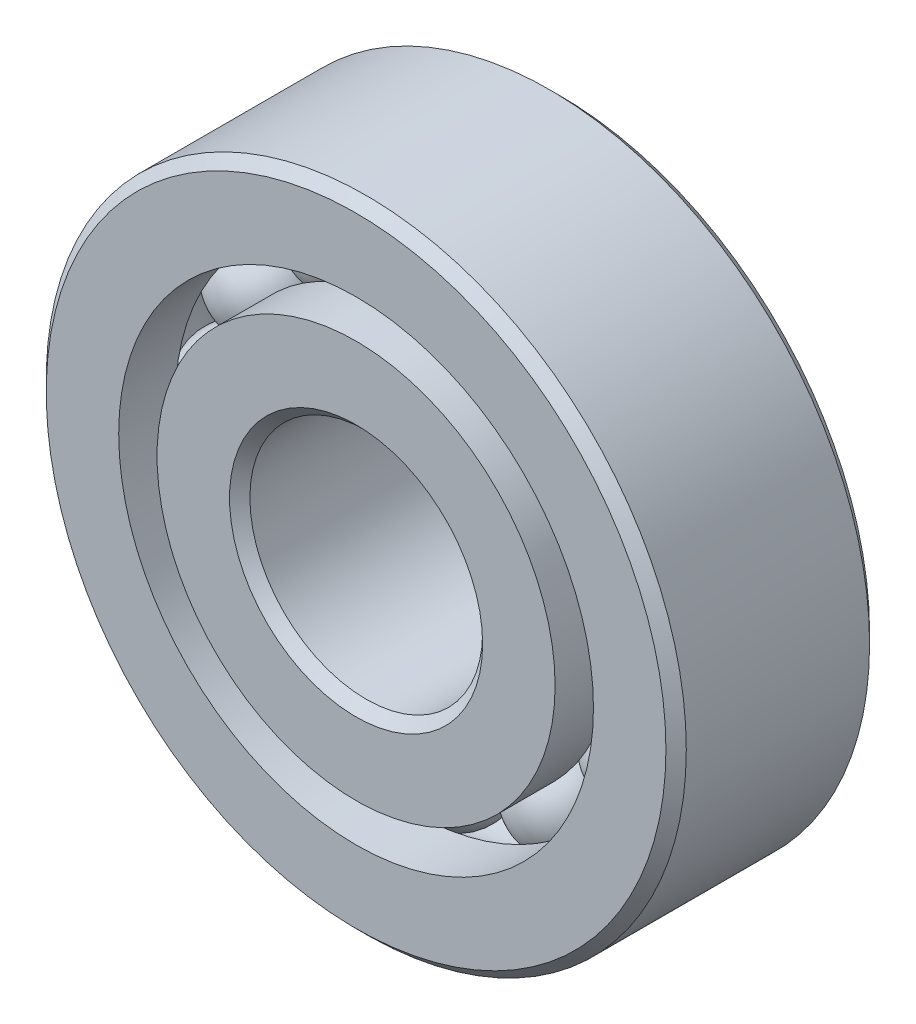
ISO-10303-21;
HEADER;
FILE_DESCRIPTION(('STEP AP214'),'2;1');
FILE_NAME('part.step','',(''),(''),'','','');
FILE_SCHEMA(('AUTOMOTIVE_DESIGN { 1 0 10303 214 1 1 1 1 }'));
ENDSEC;
DATA;
#1=APPLICATION_CONTEXT('core data for automotive mechanical design processes');
#2=APPLICATION_PROTOCOL_DEFINITION('international standard','automotive_design',2000,#1);
#3=PRODUCT_CONTEXT('',#1,'mechanical');
#4=PRODUCT('Part','Part','',(#3));
#5=PRODUCT_RELATED_PRODUCT_CATEGORY('part','',(#4));
#6=PRODUCT_DEFINITION_FORMATION('','',#4);
#7=PRODUCT_DEFINITION_CONTEXT('part definition',#1,'design');
#8=PRODUCT_DEFINITION('design','',#6,#7);
#9=PRODUCT_DEFINITION_SHAPE('','',#8);
#10=(LENGTH_UNIT() NAMED_UNIT(*) SI_UNIT(.MILLI.,.METRE.));
#11=(NAMED_UNIT(*) PLANE_ANGLE_UNIT() SI_UNIT($,.RADIAN.));
#12=(NAMED_UNIT(*) SI_UNIT($,.STERADIAN.) SOLID_ANGLE_UNIT());
#13=UNCERTAINTY_MEASURE_WITH_UNIT(LENGTH_MEASURE(1.E-05),#10,'distance_accuracy_value','');
#14=(GEOMETRIC_REPRESENTATION_CONTEXT(3) GLOBAL_UNCERTAINTY_ASSIGNED_CONTEXT((#13)) GLOBAL_UNIT_ASSIGNED_CONTEXT((#10,
#11,#12)) REPRESENTATION_CONTEXT('',''));
#15=CARTESIAN_POINT('',(0.,0.,0.));
#16=DIRECTION('',(0.,0.,1.));
#17=DIRECTION('',(1.,0.,0.));
#18=AXIS2_PLACEMENT_3D('',#15,#16,#17);
#19=CARTESIAN_POINT('',(-17.9023313525543,7.89683232637811,12.7509173422614));
#20=DIRECTION('',(0.,0.,1.));
#21=DIRECTION('',(-0.499999999999989,0.866025403784445,0.));
#22=AXIS2_PLACEMENT_3D('',#19,#20,#21);
#23=SPHERICAL_SURFACE('',#22,1.68952158656808);
#24=CARTESIAN_POINT('',(-17.9023313525543,7.89683232637811,14.4404389288295));
#25=VERTEX_POINT('',#24);
#26=VERTEX_LOOP('',#25);
#27=FACE_BOUND('',#26,.T.);
#28=ADVANCED_FACE('F42',(#27),#23,.T.);
#29=CLOSED_SHELL('',(#28));
#30=MANIFOLD_SOLID_BREP('B2',#29);
#31=CARTESIAN_POINT('',(-20.6475218809376,5.15164179799485,12.7509173422614));
#32=DIRECTION('',(0.,0.,1.));
#33=DIRECTION('',(-0.866025403784433,0.50000000000001,0.));
#34=AXIS2_PLACEMENT_3D('',#31,#32,#33);
#35=SPHERICAL_SURFACE('',#34,1.68952158656808);
#36=CARTESIAN_POINT('',(-20.6475218809376,5.15164179799485,14.4404389288295));
#37=VERTEX_POINT('',#36);
#38=VERTEX_LOOP('',#37);
#39=FACE_BOUND('',#38,.T.);
#40=ADVANCED_FACE('F63',(#39),#35,.T.);
#41=CLOSED_SHELL('',(#40));
#42=MANIFOLD_SOLID_BREP('B6',#41);
#43=CARTESIAN_POINT('',(-21.6523313525543,1.40164179799485,12.7509173422614));
#44=DIRECTION('',(0.,0.,1.));
#45=DIRECTION('',(-1.,0.,0.));
#46=AXIS2_PLACEMENT_3D('',#43,#44,#45);
#47=SPHERICAL_SURFACE('',#46,1.68952158656808);
#48=CARTESIAN_POINT('',(-21.6523313525543,1.40164179799485,14.4404389288295));
#49=VERTEX_POINT('',#48);
#50=VERTEX_LOOP('',#49);
#51=FACE_BOUND('',#50,.T.);
#52=ADVANCED_FACE('F84',(#51),#47,.T.);
#53=CLOSED_SHELL('',(#52));
#54=MANIFOLD_SOLID_BREP('B38',#53);
#55=CARTESIAN_POINT('',(-20.6475218809377,-2.34835820200516,12.7509173422614));
#56=DIRECTION('',(0.,0.,1.));
#57=DIRECTION('',(-0.866025403784443,-0.499999999999992,0.));
#58=AXIS2_PLACEMENT_3D('',#55,#56,#57);
#59=SPHERICAL_SURFACE('',#58,1.68952158656808);
#60=CARTESIAN_POINT('',(-20.6475218809377,-2.34835820200516,14.4404389288295));
#61=VERTEX_POINT('',#60);
#62=VERTEX_LOOP('',#61);
#63=FACE_BOUND('',#62,.T.);
#64=ADVANCED_FACE('F105',(#63),#59,.T.);
#65=CLOSED_SHELL('',(#64));
#66=MANIFOLD_SOLID_BREP('B59',#65);
#67=CARTESIAN_POINT('',(-17.9023313525544,-5.09354873038848,12.7509173422614));
#68=DIRECTION('',(0.,0.,1.));
#69=DIRECTION('',(-0.500000000000007,-0.866025403784435,0.));
#70=AXIS2_PLACEMENT_3D('',#67,#68,#69);
#71=SPHERICAL_SURFACE('',#70,1.68952158656808);
#72=CARTESIAN_POINT('',(-17.9023313525544,-5.09354873038848,14.4404389288295));
#73=VERTEX_POINT('',#72);
#74=VERTEX_LOOP('',#73);
#75=FACE_BOUND('',#74,.T.);
#76=ADVANCED_FACE('F126',(#75),#71,.T.);
#77=CLOSED_SHELL('',(#76));
#78=MANIFOLD_SOLID_BREP('B80',#77);
#79=CARTESIAN_POINT('',(-14.1523313525544,-6.09835820200522,12.7509173422614));
#80=DIRECTION('',(0.,0.,1.));
#81=DIRECTION('',(0.,-1.,0.));
#82=AXIS2_PLACEMENT_3D('',#79,#80,#81);
#83=SPHERICAL_SURFACE('',#82,1.68952158656808);
#84=CARTESIAN_POINT('',(-14.1523313525544,-6.09835820200522,14.4404389288295));
#85=VERTEX_POINT('',#84);
#86=VERTEX_LOOP('',#85);
#87=FACE_BOUND('',#86,.T.);
#88=ADVANCED_FACE('F147',(#87),#83,.T.);
#89=CLOSED_SHELL('',(#88));
#90=MANIFOLD_SOLID_BREP('B101',#89);
#91=CARTESIAN_POINT('',(-10.4023313525544,-5.09354873038853,12.7509173422614));
#92=DIRECTION('',(0.,0.,1.));
#93=DIRECTION('',(0.499999999999995,-0.866025403784442,0.));
#94=AXIS2_PLACEMENT_3D('',#91,#92,#93);
#95=SPHERICAL_SURFACE('',#94,1.68952158656808);
#96=CARTESIAN_POINT('',(-10.4023313525544,-5.09354873038853,14.4404389288295));
#97=VERTEX_POINT('',#96);
#98=VERTEX_LOOP('',#97);
#99=FACE_BOUND('',#98,.T.);
#100=ADVANCED_FACE('F168',(#99),#95,.T.);
#101=CLOSED_SHELL('',(#100));
#102=MANIFOLD_SOLID_BREP('B122',#101);
#103=CARTESIAN_POINT('',(-7.65714082417106,-2.34835820200525,12.7509173422614));
#104=DIRECTION('',(0.,0.,1.));
#105=DIRECTION('',(0.866025403784436,-0.500000000000004,0.));
#106=AXIS2_PLACEMENT_3D('',#103,#104,#105);
#107=SPHERICAL_SURFACE('',#106,1.68952158656808);
#108=CARTESIAN_POINT('',(-7.65714082417106,-2.34835820200525,14.4404389288295));
#109=VERTEX_POINT('',#108);
#110=VERTEX_LOOP('',#109);
#111=FACE_BOUND('',#110,.T.);
#112=ADVANCED_FACE('F189',(#111),#107,.T.);
#113=CLOSED_SHELL('',(#112));
#114=MANIFOLD_SOLID_BREP('B143',#113);
#115=CARTESIAN_POINT('',(-6.65233135255434,1.40164179799475,12.7509173422614));
#116=DIRECTION('',(0.,0.,1.));
#117=DIRECTION('',(1.,0.,0.));
#118=AXIS2_PLACEMENT_3D('',#115,#116,#117);
#119=SPHERICAL_SURFACE('',#118,1.68952158656808);
#120=CARTESIAN_POINT('',(-6.65233135255434,1.40164179799475,14.4404389288295));
#121=VERTEX_POINT('',#120);
#122=VERTEX_LOOP('',#121);
#123=FACE_BOUND('',#122,.T.);
#124=ADVANCED_FACE('F210',(#123),#119,.T.);
#125=CLOSED_SHELL('',(#124));
#126=MANIFOLD_SOLID_BREP('B164',#125);
#127=CARTESIAN_POINT('',(-7.65714082417104,5.15164179799476,12.7509173422614));
#128=DIRECTION('',(0.,0.,1.));
#129=DIRECTION('',(0.86602540378444,0.499999999999998,0.));
#130=AXIS2_PLACEMENT_3D('',#127,#128,#129);
#131=SPHERICAL_SURFACE('',#130,1.68952158656808);
#132=CARTESIAN_POINT('',(-7.65714082417104,5.15164179799476,14.4404389288295));
#133=VERTEX_POINT('',#132);
#134=VERTEX_LOOP('',#133);
#135=FACE_BOUND('',#134,.T.);
#136=ADVANCED_FACE('F231',(#135),#131,.T.);
#137=CLOSED_SHELL('',(#136));
#138=MANIFOLD_SOLID_BREP('B185',#137);
#139=CARTESIAN_POINT('',(-10.4023313525543,7.89683232637806,12.7509173422614));
#140=DIRECTION('',(0.,0.,1.));
#141=DIRECTION('',(0.500000000000001,0.866025403784438,0.));
#142=AXIS2_PLACEMENT_3D('',#139,#140,#141);
#143=SPHERICAL_SURFACE('',#142,1.68952158656808);
#144=CARTESIAN_POINT('',(-10.4023313525543,7.89683232637806,14.4404389288295));
#145=VERTEX_POINT('',#144);
#146=VERTEX_LOOP('',#145);
#147=FACE_BOUND('',#146,.T.);
#148=ADVANCED_FACE('F252',(#147),#143,.T.);
#149=CLOSED_SHELL('',(#148));
#150=MANIFOLD_SOLID_BREP('B206',#149);
#151=CARTESIAN_POINT('',(-14.1523313525543,8.90164179799478,12.7509173422614));
#152=DIRECTION('',(0.,0.,1.));
#153=DIRECTION('',(0.,1.,0.));
#154=AXIS2_PLACEMENT_3D('',#151,#152,#153);
#155=SPHERICAL_SURFACE('',#154,1.68952158656808);
#156=CARTESIAN_POINT('',(-14.1523313525543,8.90164179799478,14.4404389288295));
#157=VERTEX_POINT('',#156);
#158=VERTEX_LOOP('',#157);
#159=FACE_BOUND('',#158,.T.);
#160=ADVANCED_FACE('F275',(#159),#155,.T.);
#161=CLOSED_SHELL('',(#160));
#162=MANIFOLD_SOLID_BREP('B227',#161);
#163=CARTESIAN_POINT('',(-14.1523313525543,8.24230113865412,16.2509173422614));
#164=DIRECTION('',(0.,0.,-1.));
#165=DIRECTION('',(-1.,0.,0.));
#166=AXIS2_PLACEMENT_3D('',#163,#164,#165);
#167=PLANE('',#166);
#168=CARTESIAN_POINT('',(-14.1523313525543,1.40164179799478,16.2509173422614));
#169=DIRECTION('',(0.,0.,1.));
#170=DIRECTION('',(1.,0.,0.));
#171=AXIS2_PLACEMENT_3D('',#168,#169,#170);
#172=CIRCLE('',#171,4.35);
#173=CARTESIAN_POINT('',(-9.80233135255434,1.40164179799478,16.2509173422614));
#174=VERTEX_POINT('',#173);
#175=EDGE_CURVE('E323',#174,#174,#172,.T.);
#176=ORIENTED_EDGE('',*,*,#175,.F.);
#177=EDGE_LOOP('',(#176));
#178=FACE_BOUND('',#177,.T.);
#179=CARTESIAN_POINT('',(-14.1523313525543,1.40164179799478,16.2509173422614));
#180=DIRECTION('',(0.,0.,1.));
#181=DIRECTION('',(1.,0.,0.));
#182=AXIS2_PLACEMENT_3D('',#179,#180,#181);
#183=CIRCLE('',#182,6.84065934065934);
#184=CARTESIAN_POINT('',(-7.31167201189499,1.40164179799478,16.2509173422614));
#185=VERTEX_POINT('',#184);
#186=EDGE_CURVE('E274',#185,#185,#183,.T.);
#187=ORIENTED_EDGE('',*,*,#186,.T.);
#188=EDGE_LOOP('',(#187));
#189=FACE_BOUND('',#188,.T.);
#190=ADVANCED_FACE('F295',(#178,#189),#167,.F.);
#191=CARTESIAN_POINT('',(-14.1523313525543,1.40164179799478,16.2509173422614));
#192=DIRECTION('',(0.,0.,1.));
#193=DIRECTION('',(1.,0.,0.));
#194=AXIS2_PLACEMENT_3D('',#191,#192,#193);
#195=CYLINDRICAL_SURFACE('',#194,6.84065934065934);
#196=ORIENTED_EDGE('',*,*,#186,.F.);
#197=EDGE_LOOP('',(#196));
#198=FACE_BOUND('',#197,.T.);
#199=CARTESIAN_POINT('',(-14.1523313525543,1.40164179799478,14.3064728978169));
#200=DIRECTION('',(0.,0.,1.));
#201=DIRECTION('',(1.,0.,0.));
#202=AXIS2_PLACEMENT_3D('',#199,#200,#201);
#203=CIRCLE('',#202,6.84065934065934);
#204=CARTESIAN_POINT('',(-7.31167201189499,1.40164179799478,14.3064728978169));
#205=VERTEX_POINT('',#204);
#206=EDGE_CURVE('E301',#205,#205,#203,.T.);
#207=ORIENTED_EDGE('',*,*,#206,.T.);
#208=EDGE_LOOP('',(#207));
#209=FACE_BOUND('',#208,.T.);
#210=ADVANCED_FACE('F330',(#198,#209),#195,.T.);
#211=CARTESIAN_POINT('',(-14.1523313525543,1.40164179799478,12.7509173422614));
#212=DIRECTION('',(0.,0.,1.));
#213=DIRECTION('',(1.,0.,0.));
#214=AXIS2_PLACEMENT_3D('',#211,#212,#213);
#215=TOROIDAL_SURFACE('',#214,7.5,1.68952158656808);
#216=ORIENTED_EDGE('',*,*,#206,.F.);
#217=EDGE_LOOP('',(#216));
#218=FACE_BOUND('',#217,.T.);
#219=CARTESIAN_POINT('',(-14.1523313525543,1.40164179799478,11.1953617867058));
#220=DIRECTION('',(0.,0.,1.));
#221=DIRECTION('',(1.,0.,0.));
#222=AXIS2_PLACEMENT_3D('',#219,#220,#221);
#223=CIRCLE('',#222,6.84065934065934);
#224=CARTESIAN_POINT('',(-7.31167201189499,1.40164179799478,11.1953617867058));
#225=VERTEX_POINT('',#224);
#226=EDGE_CURVE('E305',#225,#225,#223,.T.);
#227=ORIENTED_EDGE('',*,*,#226,.T.);
#228=EDGE_LOOP('',(#227));
#229=FACE_BOUND('',#228,.T.);
#230=ADVANCED_FACE('F334',(#218,#229),#215,.F.);
#231=CARTESIAN_POINT('',(-14.1523313525543,1.40164179799478,16.2509173422614));
#232=DIRECTION('',(0.,0.,1.));
#233=DIRECTION('',(1.,0.,0.));
#234=AXIS2_PLACEMENT_3D('',#231,#232,#233);
#235=CYLINDRICAL_SURFACE('',#234,6.84065934065934);
#236=ORIENTED_EDGE('',*,*,#226,.F.);
#237=EDGE_LOOP('',(#236));
#238=FACE_BOUND('',#237,.T.);
#239=CARTESIAN_POINT('',(-14.1523313525543,1.40164179799478,9.25091734226138));
#240=DIRECTION('',(0.,0.,1.));
#241=DIRECTION('',(1.,0.,0.));
#242=AXIS2_PLACEMENT_3D('',#239,#240,#241);
#243=CIRCLE('',#242,6.84065934065934);
#244=CARTESIAN_POINT('',(-7.31167201189499,1.40164179799478,9.25091734226138));
#245=VERTEX_POINT('',#244);
#246=EDGE_CURVE('E309',#245,#245,#243,.T.);
#247=ORIENTED_EDGE('',*,*,#246,.T.);
#248=EDGE_LOOP('',(#247));
#249=FACE_BOUND('',#248,.T.);
#250=ADVANCED_FACE('F339',(#238,#249),#235,.T.);
#251=CARTESIAN_POINT('',(-14.1523313525543,5.75164179799478,9.25091734226138));
#252=DIRECTION('',(0.,0.,1.));
#253=DIRECTION('',(1.,0.,0.));
#254=AXIS2_PLACEMENT_3D('',#251,#252,#253);
#255=PLANE('',#254);
#256=ORIENTED_EDGE('',*,*,#246,.F.);
#257=EDGE_LOOP('',(#256));
#258=FACE_BOUND('',#257,.T.);
#259=CARTESIAN_POINT('',(-14.1523313525543,1.40164179799478,9.25091734226138));
#260=DIRECTION('',(0.,0.,1.));
#261=DIRECTION('',(1.,0.,0.));
#262=AXIS2_PLACEMENT_3D('',#259,#260,#261);
#263=CIRCLE('',#262,4.35);
#264=CARTESIAN_POINT('',(-9.80233135255434,1.40164179799478,9.25091734226138));
#265=VERTEX_POINT('',#264);
#266=EDGE_CURVE('E314',#265,#265,#263,.T.);
#267=ORIENTED_EDGE('',*,*,#266,.T.);
#268=EDGE_LOOP('',(#267));
#269=FACE_BOUND('',#268,.T.);
#270=ADVANCED_FACE('F345',(#258,#269),#255,.F.);
#271=CARTESIAN_POINT('',(-14.1523313525543,1.40164179799478,9.6009173422614));
#272=DIRECTION('',(0.,0.,-1.));
#273=DIRECTION('',(-1.,0.,0.));
#274=AXIS2_PLACEMENT_3D('',#271,#272,#273);
#275=CONICAL_SURFACE('',#274,4.,0.785398163397446);
#276=ORIENTED_EDGE('',*,*,#266,.F.);
#277=EDGE_LOOP('',(#276));
#278=FACE_BOUND('',#277,.T.);
#279=CARTESIAN_POINT('',(-14.1523313525543,1.40164179799478,9.6009173422614));
#280=DIRECTION('',(0.,0.,1.));
#281=DIRECTION('',(1.,0.,0.));
#282=AXIS2_PLACEMENT_3D('',#279,#280,#281);
#283=CIRCLE('',#282,4.);
#284=CARTESIAN_POINT('',(-10.1523313525543,1.40164179799478,9.6009173422614));
#285=VERTEX_POINT('',#284);
#286=EDGE_CURVE('E317',#285,#285,#283,.T.);
#287=ORIENTED_EDGE('',*,*,#286,.T.);
#288=EDGE_LOOP('',(#287));
#289=FACE_BOUND('',#288,.T.);
#290=ADVANCED_FACE('F349',(#278,#289),#275,.F.);
#291=CARTESIAN_POINT('',(-14.1523313525543,1.40164179799478,16.2509173422614));
#292=DIRECTION('',(0.,0.,1.));
#293=DIRECTION('',(1.,0.,0.));
#294=AXIS2_PLACEMENT_3D('',#291,#292,#293);
#295=CYLINDRICAL_SURFACE('',#294,4.);
#296=ORIENTED_EDGE('',*,*,#286,.F.);
#297=EDGE_LOOP('',(#296));
#298=FACE_BOUND('',#297,.T.);
#299=CARTESIAN_POINT('',(-14.1523313525543,1.40164179799478,15.9009173422614));
#300=DIRECTION('',(0.,0.,1.));
#301=DIRECTION('',(1.,0.,0.));
#302=AXIS2_PLACEMENT_3D('',#299,#300,#301);
#303=CIRCLE('',#302,4.);
#304=CARTESIAN_POINT('',(-10.1523313525543,1.40164179799478,15.9009173422614));
#305=VERTEX_POINT('',#304);
#306=EDGE_CURVE('E320',#305,#305,#303,.T.);
#307=ORIENTED_EDGE('',*,*,#306,.T.);
#308=EDGE_LOOP('',(#307));
#309=FACE_BOUND('',#308,.T.);
#310=ADVANCED_FACE('F353',(#298,#309),#295,.F.);
#311=CARTESIAN_POINT('',(-14.1523313525543,1.40164179799478,16.2509173422614));
#312=DIRECTION('',(0.,0.,1.));
#313=DIRECTION('',(1.,0.,0.));
#314=AXIS2_PLACEMENT_3D('',#311,#312,#313);
#315=CONICAL_SURFACE('',#314,4.35,0.785398163397449);
#316=ORIENTED_EDGE('',*,*,#306,.F.);
#317=EDGE_LOOP('',(#316));
#318=FACE_BOUND('',#317,.T.);
#319=ORIENTED_EDGE('',*,*,#175,.T.);
#320=EDGE_LOOP('',(#319));
#321=FACE_BOUND('',#320,.T.);
#322=ADVANCED_FACE('F327',(#318,#321),#315,.F.);
#323=CLOSED_SHELL('',(#190,#210,#230,#250,#270,#290,#310,#322));
#324=MANIFOLD_SOLID_BREP('B248',#323);
#325=CARTESIAN_POINT('',(-14.1523313525543,1.40164179799478,15.9009173422614));
#326=DIRECTION('',(0.,0.,-1.));
#327=DIRECTION('',(-1.,0.,0.));
#328=AXIS2_PLACEMENT_3D('',#325,#326,#327);
#329=CONICAL_SURFACE('',#328,11.,0.785398163397448);
#330=CARTESIAN_POINT('',(-14.1523313525543,1.40164179799478,16.2509173422614));
#331=DIRECTION('',(0.,0.,1.));
#332=DIRECTION('',(1.,0.,0.));
#333=AXIS2_PLACEMENT_3D('',#330,#331,#332);
#334=CIRCLE('',#333,10.65);
#335=CARTESIAN_POINT('',(-3.50233135255434,1.40164179799478,16.2509173422614));
#336=VERTEX_POINT('',#335);
#337=EDGE_CURVE('E445',#336,#336,#334,.T.);
#338=ORIENTED_EDGE('',*,*,#337,.F.);
#339=EDGE_LOOP('',(#338));
#340=FACE_BOUND('',#339,.T.);
#341=CARTESIAN_POINT('',(-14.1523313525543,1.40164179799478,15.9009173422614));
#342=DIRECTION('',(0.,0.,1.));
#343=DIRECTION('',(1.,0.,0.));
#344=AXIS2_PLACEMENT_3D('',#341,#342,#343);
#345=CIRCLE('',#344,11.);
#346=CARTESIAN_POINT('',(-3.15233135255434,1.40164179799478,15.9009173422614));
#347=VERTEX_POINT('',#346);
#348=EDGE_CURVE('E294',#347,#347,#345,.T.);
#349=ORIENTED_EDGE('',*,*,#348,.T.);
#350=EDGE_LOOP('',(#349));
#351=FACE_BOUND('',#350,.T.);
#352=ADVANCED_FACE('F417',(#340,#351),#329,.T.);
#353=CARTESIAN_POINT('',(-14.1523313525543,1.40164179799478,16.2509173422614));
#354=DIRECTION('',(0.,0.,1.));
#355=DIRECTION('',(1.,0.,0.));
#356=AXIS2_PLACEMENT_3D('',#353,#354,#355);
#357=CYLINDRICAL_SURFACE('',#356,11.);
#358=ORIENTED_EDGE('',*,*,#348,.F.);
#359=EDGE_LOOP('',(#358));
#360=FACE_BOUND('',#359,.T.);
#361=CARTESIAN_POINT('',(-14.1523313525543,1.40164179799478,9.60091734226137));
#362=DIRECTION('',(0.,0.,1.));
#363=DIRECTION('',(1.,0.,0.));
#364=AXIS2_PLACEMENT_3D('',#361,#362,#363);
#365=CIRCLE('',#364,11.);
#366=CARTESIAN_POINT('',(-3.15233135255434,1.40164179799478,9.60091734226137));
#367=VERTEX_POINT('',#366);
#368=EDGE_CURVE('E423',#367,#367,#365,.T.);
#369=ORIENTED_EDGE('',*,*,#368,.T.);
#370=EDGE_LOOP('',(#369));
#371=FACE_BOUND('',#370,.T.);
#372=ADVANCED_FACE('F452',(#360,#371),#357,.T.);
#373=CARTESIAN_POINT('',(-14.1523313525543,1.40164179799478,9.25091734226138));
#374=DIRECTION('',(0.,0.,1.));
#375=DIRECTION('',(1.,0.,0.));
#376=AXIS2_PLACEMENT_3D('',#373,#374,#375);
#377=CONICAL_SURFACE('',#376,10.65,0.785398163397447);
#378=ORIENTED_EDGE('',*,*,#368,.F.);
#379=EDGE_LOOP('',(#378));
#380=FACE_BOUND('',#379,.T.);
#381=CARTESIAN_POINT('',(-14.1523313525543,1.40164179799478,9.25091734226138));
#382=DIRECTION('',(0.,0.,1.));
#383=DIRECTION('',(1.,0.,0.));
#384=AXIS2_PLACEMENT_3D('',#381,#382,#383);
#385=CIRCLE('',#384,10.65);
#386=CARTESIAN_POINT('',(-3.50233135255434,1.40164179799478,9.25091734226138));
#387=VERTEX_POINT('',#386);
#388=EDGE_CURVE('E427',#387,#387,#385,.T.);
#389=ORIENTED_EDGE('',*,*,#388,.T.);
#390=EDGE_LOOP('',(#389));
#391=FACE_BOUND('',#390,.T.);
#392=ADVANCED_FACE('F456',(#380,#391),#377,.T.);
#393=CARTESIAN_POINT('',(-14.1523313525543,12.0516417979948,9.25091734226138));
#394=DIRECTION('',(0.,0.,1.));
#395=DIRECTION('',(1.,0.,0.));
#396=AXIS2_PLACEMENT_3D('',#393,#394,#395);
#397=PLANE('',#396);
#398=ORIENTED_EDGE('',*,*,#388,.F.);
#399=EDGE_LOOP('',(#398));
#400=FACE_BOUND('',#399,.T.);
#401=CARTESIAN_POINT('',(-14.1523313525543,1.40164179799478,9.25091734226138));
#402=DIRECTION('',(0.,0.,1.));
#403=DIRECTION('',(1.,0.,0.));
#404=AXIS2_PLACEMENT_3D('',#401,#402,#403);
#405=CIRCLE('',#404,8.15934065934066);
#406=CARTESIAN_POINT('',(-5.99299069321368,1.40164179799478,9.25091734226138));
#407=VERTEX_POINT('',#406);
#408=EDGE_CURVE('E431',#407,#407,#405,.T.);
#409=ORIENTED_EDGE('',*,*,#408,.T.);
#410=EDGE_LOOP('',(#409));
#411=FACE_BOUND('',#410,.T.);
#412=ADVANCED_FACE('F461',(#400,#411),#397,.F.);
#413=CARTESIAN_POINT('',(-14.1523313525543,1.40164179799478,16.2509173422614));
#414=DIRECTION('',(0.,0.,1.));
#415=DIRECTION('',(1.,0.,0.));
#416=AXIS2_PLACEMENT_3D('',#413,#414,#415);
#417=CYLINDRICAL_SURFACE('',#416,8.15934065934066);
#418=ORIENTED_EDGE('',*,*,#408,.F.);
#419=EDGE_LOOP('',(#418));
#420=FACE_BOUND('',#419,.T.);
#421=CARTESIAN_POINT('',(-14.1523313525543,1.40164179799478,11.1953617867058));
#422=DIRECTION('',(0.,0.,1.));
#423=DIRECTION('',(1.,0.,0.));
#424=AXIS2_PLACEMENT_3D('',#421,#422,#423);
#425=CIRCLE('',#424,8.15934065934066);
#426=CARTESIAN_POINT('',(-5.99299069321368,1.40164179799478,11.1953617867058));
#427=VERTEX_POINT('',#426);
#428=EDGE_CURVE('E436',#427,#427,#425,.T.);
#429=ORIENTED_EDGE('',*,*,#428,.T.);
#430=EDGE_LOOP('',(#429));
#431=FACE_BOUND('',#430,.T.);
#432=ADVANCED_FACE('F467',(#420,#431),#417,.F.);
#433=CARTESIAN_POINT('',(-14.1523313525543,1.40164179799478,12.7509173422614));
#434=DIRECTION('',(0.,0.,1.));
#435=DIRECTION('',(1.,0.,0.));
#436=AXIS2_PLACEMENT_3D('',#433,#434,#435);
#437=TOROIDAL_SURFACE('',#436,7.5,1.68952158656808);
#438=ORIENTED_EDGE('',*,*,#428,.F.);
#439=EDGE_LOOP('',(#438));
#440=FACE_BOUND('',#439,.T.);
#441=CARTESIAN_POINT('',(-14.1523313525543,1.40164179799478,14.3064728978169));
#442=DIRECTION('',(0.,0.,1.));
#443=DIRECTION('',(1.,0.,0.));
#444=AXIS2_PLACEMENT_3D('',#441,#442,#443);
#445=CIRCLE('',#444,8.15934065934066);
#446=CARTESIAN_POINT('',(-5.99299069321368,1.40164179799478,14.3064728978169));
#447=VERTEX_POINT('',#446);
#448=EDGE_CURVE('E439',#447,#447,#445,.T.);
#449=ORIENTED_EDGE('',*,*,#448,.T.);
#450=EDGE_LOOP('',(#449));
#451=FACE_BOUND('',#450,.T.);
#452=ADVANCED_FACE('F471',(#440,#451),#437,.F.);
#453=CARTESIAN_POINT('',(-14.1523313525543,1.40164179799478,16.2509173422614));
#454=DIRECTION('',(0.,0.,1.));
#455=DIRECTION('',(1.,0.,0.));
#456=AXIS2_PLACEMENT_3D('',#453,#454,#455);
#457=CYLINDRICAL_SURFACE('',#456,8.15934065934066);
#458=ORIENTED_EDGE('',*,*,#448,.F.);
#459=EDGE_LOOP('',(#458));
#460=FACE_BOUND('',#459,.T.);
#461=CARTESIAN_POINT('',(-14.1523313525543,1.40164179799478,16.2509173422614));
#462=DIRECTION('',(0.,0.,1.));
#463=DIRECTION('',(1.,0.,0.));
#464=AXIS2_PLACEMENT_3D('',#461,#462,#463);
#465=CIRCLE('',#464,8.15934065934066);
#466=CARTESIAN_POINT('',(-5.99299069321368,1.40164179799478,16.2509173422614));
#467=VERTEX_POINT('',#466);
#468=EDGE_CURVE('E442',#467,#467,#465,.T.);
#469=ORIENTED_EDGE('',*,*,#468,.T.);
#470=EDGE_LOOP('',(#469));
#471=FACE_BOUND('',#470,.T.);
#472=ADVANCED_FACE('F475',(#460,#471),#457,.F.);
#473=CARTESIAN_POINT('',(-14.1523313525543,12.0516417979948,16.2509173422614));
#474=DIRECTION('',(0.,0.,-1.));
#475=DIRECTION('',(-1.,0.,0.));
#476=AXIS2_PLACEMENT_3D('',#473,#474,#475);
#477=PLANE('',#476);
#478=ORIENTED_EDGE('',*,*,#468,.F.);
#479=EDGE_LOOP('',(#478));
#480=FACE_BOUND('',#479,.T.);
#481=ORIENTED_EDGE('',*,*,#337,.T.);
#482=EDGE_LOOP('',(#481));
#483=FACE_BOUND('',#482,.T.);
#484=ADVANCED_FACE('F449',(#480,#483),#477,.F.);
#485=CLOSED_SHELL('',(#352,#372,#392,#412,#432,#452,#472,#484));
#486=MANIFOLD_SOLID_BREP('B269',#485);
#487=ADVANCED_BREP_SHAPE_REPRESENTATION('',(#18,#30,#42,#54,#66,#78,#90,#102,#114,#126,#138,
#150,#162,#324,#486),#14);
#488=SHAPE_DEFINITION_REPRESENTATION(#9,#487);
ENDSEC;
END-ISO-10303-21;
